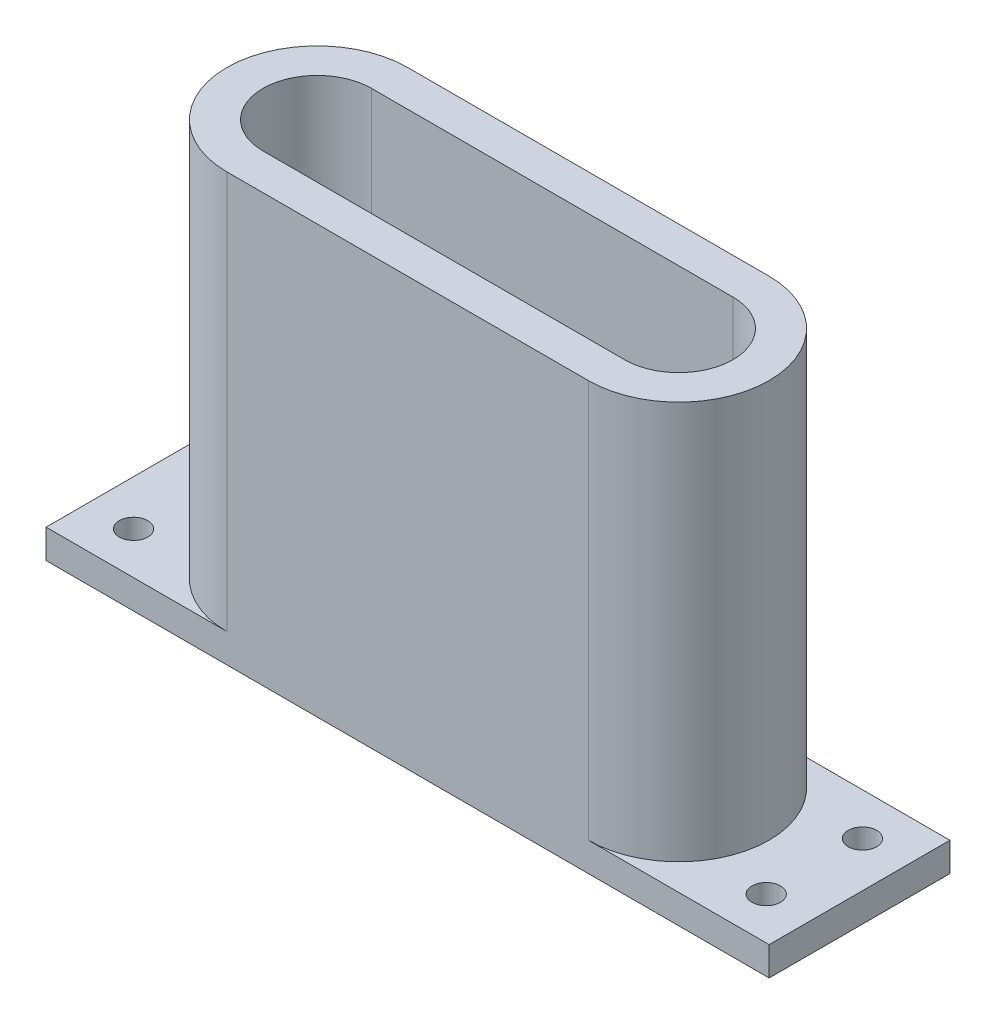
ISO-10303-21;
HEADER;
FILE_DESCRIPTION(('STEP AP214'),'2;1');
FILE_NAME('part.step','',(''),(''),'','','');
FILE_SCHEMA(('AUTOMOTIVE_DESIGN { 1 0 10303 214 1 1 1 1 }'));
ENDSEC;
DATA;
#1=APPLICATION_CONTEXT('core data for automotive mechanical design processes');
#2=APPLICATION_PROTOCOL_DEFINITION('international standard','automotive_design',2000,#1);
#3=PRODUCT_CONTEXT('',#1,'mechanical');
#4=PRODUCT('Part','Part','',(#3));
#5=PRODUCT_RELATED_PRODUCT_CATEGORY('part','',(#4));
#6=PRODUCT_DEFINITION_FORMATION('','',#4);
#7=PRODUCT_DEFINITION_CONTEXT('part definition',#1,'design');
#8=PRODUCT_DEFINITION('design','',#6,#7);
#9=PRODUCT_DEFINITION_SHAPE('','',#8);
#10=(LENGTH_UNIT() NAMED_UNIT(*) SI_UNIT(.MILLI.,.METRE.));
#11=(NAMED_UNIT(*) PLANE_ANGLE_UNIT() SI_UNIT($,.RADIAN.));
#12=(NAMED_UNIT(*) SI_UNIT($,.STERADIAN.) SOLID_ANGLE_UNIT());
#13=UNCERTAINTY_MEASURE_WITH_UNIT(LENGTH_MEASURE(1.E-05),#10,'distance_accuracy_value','');
#14=(GEOMETRIC_REPRESENTATION_CONTEXT(3) GLOBAL_UNCERTAINTY_ASSIGNED_CONTEXT((#13)) GLOBAL_UNIT_ASSIGNED_CONTEXT((#10,
#11,#12)) REPRESENTATION_CONTEXT('',''));
#15=CARTESIAN_POINT('',(0.,0.,0.));
#16=DIRECTION('',(0.,0.,1.));
#17=DIRECTION('',(1.,0.,0.));
#18=AXIS2_PLACEMENT_3D('',#15,#16,#17);
#19=CARTESIAN_POINT('',(-25.4,60.,0.));
#20=DIRECTION('',(0.,1.,0.));
#21=DIRECTION('',(0.,0.,1.));
#22=AXIS2_PLACEMENT_3D('',#19,#20,#21);
#23=PLANE('',#22);
#24=CARTESIAN_POINT('',(-25.4,60.,0.));
#25=DIRECTION('',(0.,1.,0.));
#26=DIRECTION('',(0.,0.,1.));
#27=AXIS2_PLACEMENT_3D('',#24,#25,#26);
#28=CIRCLE('',#27,12.7);
#29=CARTESIAN_POINT('',(-25.4,60.,-12.7));
#30=VERTEX_POINT('',#29);
#31=CARTESIAN_POINT('',(-25.4,60.,12.7));
#32=VERTEX_POINT('',#31);
#33=EDGE_CURVE('E209',#30,#32,#28,.T.);
#34=ORIENTED_EDGE('',*,*,#33,.T.);
#35=DIRECTION('',(1.,0.,0.));
#36=VECTOR('',#35,1.);
#37=CARTESIAN_POINT('',(-25.4,60.,12.7));
#38=LINE('',#37,#36);
#39=CARTESIAN_POINT('',(25.4,60.,12.7));
#40=VERTEX_POINT('',#39);
#41=EDGE_CURVE('E212',#32,#40,#38,.T.);
#42=ORIENTED_EDGE('',*,*,#41,.T.);
#43=CARTESIAN_POINT('',(25.4,60.,0.));
#44=DIRECTION('',(0.,1.,0.));
#45=DIRECTION('',(0.,0.,1.));
#46=AXIS2_PLACEMENT_3D('',#43,#44,#45);
#47=CIRCLE('',#46,12.7);
#48=CARTESIAN_POINT('',(25.4,60.,-12.7));
#49=VERTEX_POINT('',#48);
#50=EDGE_CURVE('E214',#40,#49,#47,.T.);
#51=ORIENTED_EDGE('',*,*,#50,.T.);
#52=DIRECTION('',(-1.,0.,0.));
#53=VECTOR('',#52,1.);
#54=CARTESIAN_POINT('',(-25.4,60.,-12.7));
#55=LINE('',#54,#53);
#56=EDGE_CURVE('E216',#49,#30,#55,.T.);
#57=ORIENTED_EDGE('',*,*,#56,.T.);
#58=EDGE_LOOP('',(#34,#42,#51,#57));
#59=FACE_BOUND('',#58,.T.);
#60=DIRECTION('',(1.,0.,0.));
#61=VECTOR('',#60,1.);
#62=CARTESIAN_POINT('',(-25.4,60.,7.61999999999998));
#63=LINE('',#62,#61);
#64=CARTESIAN_POINT('',(-25.4,60.,7.61999999999998));
#65=VERTEX_POINT('',#64);
#66=CARTESIAN_POINT('',(25.4000000000001,60.,7.62));
#67=VERTEX_POINT('',#66);
#68=EDGE_CURVE('E182',#65,#67,#63,.T.);
#69=ORIENTED_EDGE('',*,*,#68,.F.);
#70=CARTESIAN_POINT('',(-25.4,60.,0.));
#71=DIRECTION('',(0.,1.,0.));
#72=DIRECTION('',(0.,0.,1.));
#73=AXIS2_PLACEMENT_3D('',#70,#71,#72);
#74=CIRCLE('',#73,7.61999999999999);
#75=CARTESIAN_POINT('',(-25.4,60.,-7.61999999999999));
#76=VERTEX_POINT('',#75);
#77=EDGE_CURVE('E180',#76,#65,#74,.T.);
#78=ORIENTED_EDGE('',*,*,#77,.F.);
#79=DIRECTION('',(-1.,0.,0.));
#80=VECTOR('',#79,1.);
#81=CARTESIAN_POINT('',(-25.4,60.,-7.61999999999999));
#82=LINE('',#81,#80);
#83=CARTESIAN_POINT('',(25.4,60.,-7.62));
#84=VERTEX_POINT('',#83);
#85=EDGE_CURVE('E188',#84,#76,#82,.T.);
#86=ORIENTED_EDGE('',*,*,#85,.F.);
#87=CARTESIAN_POINT('',(25.4,60.,0.));
#88=DIRECTION('',(0.,1.,0.));
#89=DIRECTION('',(0.,0.,1.));
#90=AXIS2_PLACEMENT_3D('',#87,#88,#89);
#91=CIRCLE('',#90,7.62);
#92=EDGE_CURVE('E185',#67,#84,#91,.T.);
#93=ORIENTED_EDGE('',*,*,#92,.F.);
#94=EDGE_LOOP('',(#69,#78,#86,#93));
#95=FACE_BOUND('',#94,.T.);
#96=ADVANCED_FACE('F39',(#59,#95),#23,.T.);
#97=CARTESIAN_POINT('',(-25.4,0.,0.));
#98=DIRECTION('',(0.,1.,0.));
#99=DIRECTION('',(0.,0.,1.));
#100=AXIS2_PLACEMENT_3D('',#97,#98,#99);
#101=PLANE('',#100);
#102=DIRECTION('',(1.,0.,0.));
#103=VECTOR('',#102,1.);
#104=CARTESIAN_POINT('',(-25.4,0.,12.7));
#105=LINE('',#104,#103);
#106=CARTESIAN_POINT('',(-50.7999999999999,0.,12.7));
#107=VERTEX_POINT('',#106);
#108=CARTESIAN_POINT('',(50.8,0.,12.7));
#109=VERTEX_POINT('',#108);
#110=EDGE_CURVE('E208',#107,#109,#105,.T.);
#111=ORIENTED_EDGE('',*,*,#110,.F.);
#112=DIRECTION('',(0.,0.,-1.));
#113=VECTOR('',#112,1.);
#114=CARTESIAN_POINT('',(-50.7999999999999,0.,-12.7));
#115=LINE('',#114,#113);
#116=CARTESIAN_POINT('',(-50.7999999999999,0.,-12.7));
#117=VERTEX_POINT('',#116);
#118=EDGE_CURVE('E158',#107,#117,#115,.T.);
#119=ORIENTED_EDGE('',*,*,#118,.T.);
#120=DIRECTION('',(-1.,0.,0.));
#121=VECTOR('',#120,1.);
#122=CARTESIAN_POINT('',(-25.4,0.,-12.7));
#123=LINE('',#122,#121);
#124=CARTESIAN_POINT('',(50.8,0.,-12.7));
#125=VERTEX_POINT('',#124);
#126=EDGE_CURVE('E135',#125,#117,#123,.T.);
#127=ORIENTED_EDGE('',*,*,#126,.F.);
#128=DIRECTION('',(0.,0.,1.));
#129=VECTOR('',#128,1.);
#130=CARTESIAN_POINT('',(50.8,0.,-12.7));
#131=LINE('',#130,#129);
#132=EDGE_CURVE('E155',#125,#109,#131,.T.);
#133=ORIENTED_EDGE('',*,*,#132,.T.);
#134=EDGE_LOOP('',(#111,#119,#127,#133));
#135=FACE_BOUND('',#134,.T.);
#136=CARTESIAN_POINT('',(-25.4,0.,0.));
#137=DIRECTION('',(0.,1.,0.));
#138=DIRECTION('',(0.,0.,1.));
#139=AXIS2_PLACEMENT_3D('',#136,#137,#138);
#140=CIRCLE('',#139,7.61999999999999);
#141=CARTESIAN_POINT('',(-25.4,0.,-7.61999999999999));
#142=VERTEX_POINT('',#141);
#143=CARTESIAN_POINT('',(-25.4,0.,7.61999999999998));
#144=VERTEX_POINT('',#143);
#145=EDGE_CURVE('E179',#142,#144,#140,.T.);
#146=ORIENTED_EDGE('',*,*,#145,.T.);
#147=DIRECTION('',(1.,0.,0.));
#148=VECTOR('',#147,1.);
#149=CARTESIAN_POINT('',(-25.4,0.,7.61999999999998));
#150=LINE('',#149,#148);
#151=CARTESIAN_POINT('',(25.4000000000001,0.,7.62));
#152=VERTEX_POINT('',#151);
#153=EDGE_CURVE('E193',#144,#152,#150,.T.);
#154=ORIENTED_EDGE('',*,*,#153,.T.);
#155=CARTESIAN_POINT('',(25.4,0.,0.));
#156=DIRECTION('',(0.,1.,0.));
#157=DIRECTION('',(0.,0.,1.));
#158=AXIS2_PLACEMENT_3D('',#155,#156,#157);
#159=CIRCLE('',#158,7.62);
#160=CARTESIAN_POINT('',(25.4,0.,-7.62));
#161=VERTEX_POINT('',#160);
#162=EDGE_CURVE('E196',#152,#161,#159,.T.);
#163=ORIENTED_EDGE('',*,*,#162,.T.);
#164=DIRECTION('',(-1.,0.,0.));
#165=VECTOR('',#164,1.);
#166=CARTESIAN_POINT('',(-25.4,0.,-7.61999999999999));
#167=LINE('',#166,#165);
#168=EDGE_CURVE('E183',#161,#142,#167,.T.);
#169=ORIENTED_EDGE('',*,*,#168,.T.);
#170=EDGE_LOOP('',(#146,#154,#163,#169));
#171=FACE_BOUND('',#170,.T.);
#172=CARTESIAN_POINT('',(44.45,0.,6.76285674396147));
#173=DIRECTION('',(0.,-1.,0.));
#174=DIRECTION('',(0.,0.,1.));
#175=AXIS2_PLACEMENT_3D('',#172,#173,#174);
#176=CIRCLE('',#175,2.);
#177=CARTESIAN_POINT('',(44.45,0.,8.76285674396148));
#178=VERTEX_POINT('',#177);
#179=EDGE_CURVE('E306',#178,#178,#176,.T.);
#180=ORIENTED_EDGE('',*,*,#179,.F.);
#181=EDGE_LOOP('',(#180));
#182=FACE_BOUND('',#181,.T.);
#183=CARTESIAN_POINT('',(44.45,0.,-6.76285674396148));
#184=DIRECTION('',(0.,-1.,0.));
#185=DIRECTION('',(0.,0.,1.));
#186=AXIS2_PLACEMENT_3D('',#183,#184,#185);
#187=CIRCLE('',#186,2.);
#188=CARTESIAN_POINT('',(44.45,0.,-4.76285674396147));
#189=VERTEX_POINT('',#188);
#190=EDGE_CURVE('E303',#189,#189,#187,.T.);
#191=ORIENTED_EDGE('',*,*,#190,.F.);
#192=EDGE_LOOP('',(#191));
#193=FACE_BOUND('',#192,.T.);
#194=CARTESIAN_POINT('',(-44.45,0.,-6.76285674396148));
#195=DIRECTION('',(0.,-1.,0.));
#196=DIRECTION('',(0.,0.,-1.));
#197=AXIS2_PLACEMENT_3D('',#194,#195,#196);
#198=CIRCLE('',#197,2.);
#199=CARTESIAN_POINT('',(-44.45,0.,-8.76285674396148));
#200=VERTEX_POINT('',#199);
#201=EDGE_CURVE('E161',#200,#200,#198,.T.);
#202=ORIENTED_EDGE('',*,*,#201,.F.);
#203=EDGE_LOOP('',(#202));
#204=FACE_BOUND('',#203,.T.);
#205=CARTESIAN_POINT('',(-44.45,0.,6.76285674396147));
#206=DIRECTION('',(0.,-1.,0.));
#207=DIRECTION('',(0.,0.,-1.));
#208=AXIS2_PLACEMENT_3D('',#205,#206,#207);
#209=CIRCLE('',#208,2.);
#210=CARTESIAN_POINT('',(-44.45,0.,4.76285674396147));
#211=VERTEX_POINT('',#210);
#212=EDGE_CURVE('E312',#211,#211,#209,.T.);
#213=ORIENTED_EDGE('',*,*,#212,.F.);
#214=EDGE_LOOP('',(#213));
#215=FACE_BOUND('',#214,.T.);
#216=ADVANCED_FACE('F235',(#135,#171,#182,#193,#204,#215),#101,.F.);
#217=CARTESIAN_POINT('',(-25.4,60.,0.));
#218=DIRECTION('',(0.,-1.,0.));
#219=DIRECTION('',(0.,0.,-1.));
#220=AXIS2_PLACEMENT_3D('',#217,#218,#219);
#221=CYLINDRICAL_SURFACE('',#220,12.7);
#222=DIRECTION('',(0.,-1.,0.));
#223=VECTOR('',#222,1.);
#224=CARTESIAN_POINT('',(-25.4,60.,-12.7));
#225=LINE('',#224,#223);
#226=CARTESIAN_POINT('',(-25.4,4.064,-12.7));
#227=VERTEX_POINT('',#226);
#228=EDGE_CURVE('E218',#30,#227,#225,.T.);
#229=ORIENTED_EDGE('',*,*,#228,.T.);
#230=CARTESIAN_POINT('',(-25.4,4.064,0.));
#231=DIRECTION('',(0.,1.,0.));
#232=DIRECTION('',(0.,0.,1.));
#233=AXIS2_PLACEMENT_3D('',#230,#231,#232);
#234=CIRCLE('',#233,12.7);
#235=CARTESIAN_POINT('',(-25.4,4.064,12.7));
#236=VERTEX_POINT('',#235);
#237=EDGE_CURVE('E54',#227,#236,#234,.T.);
#238=ORIENTED_EDGE('',*,*,#237,.T.);
#239=DIRECTION('',(0.,-1.,0.));
#240=VECTOR('',#239,1.);
#241=CARTESIAN_POINT('',(-25.4,60.,12.7));
#242=LINE('',#241,#240);
#243=EDGE_CURVE('E11',#32,#236,#242,.T.);
#244=ORIENTED_EDGE('',*,*,#243,.F.);
#245=ORIENTED_EDGE('',*,*,#33,.F.);
#246=EDGE_LOOP('',(#229,#238,#244,#245));
#247=FACE_BOUND('',#246,.T.);
#248=ADVANCED_FACE('F41',(#247),#221,.T.);
#249=CARTESIAN_POINT('',(-25.4,60.,12.7));
#250=DIRECTION('',(0.,0.,-1.));
#251=DIRECTION('',(-1.,0.,0.));
#252=AXIS2_PLACEMENT_3D('',#249,#250,#251);
#253=PLANE('',#252);
#254=ORIENTED_EDGE('',*,*,#243,.T.);
#255=DIRECTION('',(-1.,0.,0.));
#256=VECTOR('',#255,1.);
#257=CARTESIAN_POINT('',(-50.7999999999999,4.064,12.7));
#258=LINE('',#257,#256);
#259=CARTESIAN_POINT('',(-50.7999999999999,4.064,12.7));
#260=VERTEX_POINT('',#259);
#261=EDGE_CURVE('E166',#236,#260,#258,.T.);
#262=ORIENTED_EDGE('',*,*,#261,.T.);
#263=DIRECTION('',(0.,-1.,0.));
#264=VECTOR('',#263,1.);
#265=CARTESIAN_POINT('',(-50.7999999999999,4.064,12.7));
#266=LINE('',#265,#264);
#267=EDGE_CURVE('E154',#260,#107,#266,.T.);
#268=ORIENTED_EDGE('',*,*,#267,.T.);
#269=ORIENTED_EDGE('',*,*,#110,.T.);
#270=DIRECTION('',(0.,-1.,0.));
#271=VECTOR('',#270,1.);
#272=CARTESIAN_POINT('',(50.8,4.064,12.7));
#273=LINE('',#272,#271);
#274=CARTESIAN_POINT('',(50.8,4.064,12.7));
#275=VERTEX_POINT('',#274);
#276=EDGE_CURVE('E173',#275,#109,#273,.T.);
#277=ORIENTED_EDGE('',*,*,#276,.F.);
#278=CARTESIAN_POINT('',(25.4,4.064,12.7));
#279=VERTEX_POINT('',#278);
#280=EDGE_CURVE('E141',#275,#279,#258,.T.);
#281=ORIENTED_EDGE('',*,*,#280,.T.);
#282=DIRECTION('',(0.,-1.,0.));
#283=VECTOR('',#282,1.);
#284=CARTESIAN_POINT('',(25.4,60.,12.7));
#285=LINE('',#284,#283);
#286=EDGE_CURVE('E47',#40,#279,#285,.T.);
#287=ORIENTED_EDGE('',*,*,#286,.F.);
#288=ORIENTED_EDGE('',*,*,#41,.F.);
#289=EDGE_LOOP('',(#254,#262,#268,#269,#277,#281,#287,#288));
#290=FACE_BOUND('',#289,.T.);
#291=ADVANCED_FACE('F238',(#290),#253,.F.);
#292=CARTESIAN_POINT('',(25.4,60.,0.));
#293=DIRECTION('',(0.,-1.,0.));
#294=DIRECTION('',(0.,0.,-1.));
#295=AXIS2_PLACEMENT_3D('',#292,#293,#294);
#296=CYLINDRICAL_SURFACE('',#295,12.7);
#297=ORIENTED_EDGE('',*,*,#286,.T.);
#298=CARTESIAN_POINT('',(25.4,4.064,0.));
#299=DIRECTION('',(0.,1.,0.));
#300=DIRECTION('',(0.,0.,1.));
#301=AXIS2_PLACEMENT_3D('',#298,#299,#300);
#302=CIRCLE('',#301,12.7);
#303=CARTESIAN_POINT('',(25.4,4.064,-12.7));
#304=VERTEX_POINT('',#303);
#305=EDGE_CURVE('E172',#279,#304,#302,.T.);
#306=ORIENTED_EDGE('',*,*,#305,.T.);
#307=DIRECTION('',(0.,-1.,0.));
#308=VECTOR('',#307,1.);
#309=CARTESIAN_POINT('',(25.4,60.,-12.7));
#310=LINE('',#309,#308);
#311=EDGE_CURVE('E222',#49,#304,#310,.T.);
#312=ORIENTED_EDGE('',*,*,#311,.F.);
#313=ORIENTED_EDGE('',*,*,#50,.F.);
#314=EDGE_LOOP('',(#297,#306,#312,#313));
#315=FACE_BOUND('',#314,.T.);
#316=ADVANCED_FACE('F242',(#315),#296,.T.);
#317=CARTESIAN_POINT('',(-25.4,60.,-12.7));
#318=DIRECTION('',(0.,0.,1.));
#319=DIRECTION('',(1.,0.,0.));
#320=AXIS2_PLACEMENT_3D('',#317,#318,#319);
#321=PLANE('',#320);
#322=ORIENTED_EDGE('',*,*,#311,.T.);
#323=DIRECTION('',(1.,0.,0.));
#324=VECTOR('',#323,1.);
#325=CARTESIAN_POINT('',(-50.7999999999999,4.064,-12.7));
#326=LINE('',#325,#324);
#327=CARTESIAN_POINT('',(50.8,4.064,-12.7));
#328=VERTEX_POINT('',#327);
#329=EDGE_CURVE('E149',#304,#328,#326,.T.);
#330=ORIENTED_EDGE('',*,*,#329,.T.);
#331=DIRECTION('',(0.,-1.,0.));
#332=VECTOR('',#331,1.);
#333=CARTESIAN_POINT('',(50.8,4.064,-12.7));
#334=LINE('',#333,#332);
#335=EDGE_CURVE('E140',#328,#125,#334,.T.);
#336=ORIENTED_EDGE('',*,*,#335,.T.);
#337=ORIENTED_EDGE('',*,*,#126,.T.);
#338=DIRECTION('',(0.,-1.,0.));
#339=VECTOR('',#338,1.);
#340=CARTESIAN_POINT('',(-50.7999999999999,4.064,-12.7));
#341=LINE('',#340,#339);
#342=CARTESIAN_POINT('',(-50.7999999999999,4.064,-12.7));
#343=VERTEX_POINT('',#342);
#344=EDGE_CURVE('E128',#343,#117,#341,.T.);
#345=ORIENTED_EDGE('',*,*,#344,.F.);
#346=EDGE_CURVE('E133',#343,#227,#326,.T.);
#347=ORIENTED_EDGE('',*,*,#346,.T.);
#348=ORIENTED_EDGE('',*,*,#228,.F.);
#349=ORIENTED_EDGE('',*,*,#56,.F.);
#350=EDGE_LOOP('',(#322,#330,#336,#337,#345,#347,#348,#349));
#351=FACE_BOUND('',#350,.T.);
#352=ADVANCED_FACE('F131',(#351),#321,.F.);
#353=CARTESIAN_POINT('',(-25.4,60.,0.));
#354=DIRECTION('',(0.,-1.,0.));
#355=DIRECTION('',(0.,0.,-1.));
#356=AXIS2_PLACEMENT_3D('',#353,#354,#355);
#357=CYLINDRICAL_SURFACE('',#356,7.61999999999999);
#358=DIRECTION('',(0.,-1.,0.));
#359=VECTOR('',#358,1.);
#360=CARTESIAN_POINT('',(-25.4,60.,7.61999999999998));
#361=LINE('',#360,#359);
#362=EDGE_CURVE('E206',#65,#144,#361,.T.);
#363=ORIENTED_EDGE('',*,*,#362,.T.);
#364=ORIENTED_EDGE('',*,*,#145,.F.);
#365=DIRECTION('',(0.,-1.,0.));
#366=VECTOR('',#365,1.);
#367=CARTESIAN_POINT('',(-25.4,60.,-7.61999999999999));
#368=LINE('',#367,#366);
#369=EDGE_CURVE('E190',#76,#142,#368,.T.);
#370=ORIENTED_EDGE('',*,*,#369,.F.);
#371=ORIENTED_EDGE('',*,*,#77,.T.);
#372=EDGE_LOOP('',(#363,#364,#370,#371));
#373=FACE_BOUND('',#372,.T.);
#374=ADVANCED_FACE('F249',(#373),#357,.F.);
#375=CARTESIAN_POINT('',(-25.4,60.,7.61999999999998));
#376=DIRECTION('',(0.,0.,-1.));
#377=DIRECTION('',(-1.,0.,0.));
#378=AXIS2_PLACEMENT_3D('',#375,#376,#377);
#379=PLANE('',#378);
#380=DIRECTION('',(0.,-1.,0.));
#381=VECTOR('',#380,1.);
#382=CARTESIAN_POINT('',(25.4000000000001,60.,7.62));
#383=LINE('',#382,#381);
#384=EDGE_CURVE('E204',#67,#152,#383,.T.);
#385=ORIENTED_EDGE('',*,*,#384,.T.);
#386=ORIENTED_EDGE('',*,*,#153,.F.);
#387=ORIENTED_EDGE('',*,*,#362,.F.);
#388=ORIENTED_EDGE('',*,*,#68,.T.);
#389=EDGE_LOOP('',(#385,#386,#387,#388));
#390=FACE_BOUND('',#389,.T.);
#391=ADVANCED_FACE('F260',(#390),#379,.T.);
#392=CARTESIAN_POINT('',(25.4,60.,0.));
#393=DIRECTION('',(0.,-1.,0.));
#394=DIRECTION('',(0.,0.,-1.));
#395=AXIS2_PLACEMENT_3D('',#392,#393,#394);
#396=CYLINDRICAL_SURFACE('',#395,7.62);
#397=DIRECTION('',(0.,-1.,0.));
#398=VECTOR('',#397,1.);
#399=CARTESIAN_POINT('',(25.4,60.,-7.62));
#400=LINE('',#399,#398);
#401=EDGE_CURVE('E202',#84,#161,#400,.T.);
#402=ORIENTED_EDGE('',*,*,#401,.T.);
#403=ORIENTED_EDGE('',*,*,#162,.F.);
#404=ORIENTED_EDGE('',*,*,#384,.F.);
#405=ORIENTED_EDGE('',*,*,#92,.T.);
#406=EDGE_LOOP('',(#402,#403,#404,#405));
#407=FACE_BOUND('',#406,.T.);
#408=ADVANCED_FACE('F264',(#407),#396,.F.);
#409=CARTESIAN_POINT('',(-25.4,60.,-7.61999999999999));
#410=DIRECTION('',(0.,0.,1.));
#411=DIRECTION('',(1.,0.,0.));
#412=AXIS2_PLACEMENT_3D('',#409,#410,#411);
#413=PLANE('',#412);
#414=ORIENTED_EDGE('',*,*,#369,.T.);
#415=ORIENTED_EDGE('',*,*,#168,.F.);
#416=ORIENTED_EDGE('',*,*,#401,.F.);
#417=ORIENTED_EDGE('',*,*,#85,.T.);
#418=EDGE_LOOP('',(#414,#415,#416,#417));
#419=FACE_BOUND('',#418,.T.);
#420=ADVANCED_FACE('F268',(#419),#413,.T.);
#421=CARTESIAN_POINT('',(50.8,4.064,-12.7));
#422=DIRECTION('',(1.,0.,0.));
#423=DIRECTION('',(0.,0.,-1.));
#424=AXIS2_PLACEMENT_3D('',#421,#422,#423);
#425=PLANE('',#424);
#426=ORIENTED_EDGE('',*,*,#132,.F.);
#427=ORIENTED_EDGE('',*,*,#335,.F.);
#428=DIRECTION('',(0.,0.,1.));
#429=VECTOR('',#428,1.);
#430=CARTESIAN_POINT('',(50.8,4.064,-12.7));
#431=LINE('',#430,#429);
#432=EDGE_CURVE('E148',#328,#275,#431,.T.);
#433=ORIENTED_EDGE('',*,*,#432,.T.);
#434=ORIENTED_EDGE('',*,*,#276,.T.);
#435=EDGE_LOOP('',(#426,#427,#433,#434));
#436=FACE_BOUND('',#435,.T.);
#437=ADVANCED_FACE('F233',(#436),#425,.T.);
#438=CARTESIAN_POINT('',(44.45,4.064,-6.76285674396148));
#439=DIRECTION('',(0.,-1.,0.));
#440=DIRECTION('',(0.,0.,-1.));
#441=AXIS2_PLACEMENT_3D('',#438,#439,#440);
#442=CYLINDRICAL_SURFACE('',#441,2.);
#443=CARTESIAN_POINT('',(44.45,4.064,-6.76285674396148));
#444=DIRECTION('',(0.,-1.,0.));
#445=DIRECTION('',(0.,0.,1.));
#446=AXIS2_PLACEMENT_3D('',#443,#444,#445);
#447=CIRCLE('',#446,2.);
#448=CARTESIAN_POINT('',(44.45,4.064,-4.76285674396147));
#449=VERTEX_POINT('',#448);
#450=EDGE_CURVE('E300',#449,#449,#447,.T.);
#451=ORIENTED_EDGE('',*,*,#450,.F.);
#452=EDGE_LOOP('',(#451));
#453=FACE_BOUND('',#452,.T.);
#454=ORIENTED_EDGE('',*,*,#190,.T.);
#455=EDGE_LOOP('',(#454));
#456=FACE_BOUND('',#455,.T.);
#457=ADVANCED_FACE('F278',(#453,#456),#442,.F.);
#458=CARTESIAN_POINT('',(44.45,4.064,6.76285674396147));
#459=DIRECTION('',(0.,-1.,0.));
#460=DIRECTION('',(0.,0.,-1.));
#461=AXIS2_PLACEMENT_3D('',#458,#459,#460);
#462=CYLINDRICAL_SURFACE('',#461,2.);
#463=CARTESIAN_POINT('',(44.45,4.064,6.76285674396147));
#464=DIRECTION('',(0.,-1.,0.));
#465=DIRECTION('',(0.,0.,1.));
#466=AXIS2_PLACEMENT_3D('',#463,#464,#465);
#467=CIRCLE('',#466,2.);
#468=CARTESIAN_POINT('',(44.45,4.064,8.76285674396148));
#469=VERTEX_POINT('',#468);
#470=EDGE_CURVE('E309',#469,#469,#467,.T.);
#471=ORIENTED_EDGE('',*,*,#470,.F.);
#472=EDGE_LOOP('',(#471));
#473=FACE_BOUND('',#472,.T.);
#474=ORIENTED_EDGE('',*,*,#179,.T.);
#475=EDGE_LOOP('',(#474));
#476=FACE_BOUND('',#475,.T.);
#477=ADVANCED_FACE('F289',(#473,#476),#462,.F.);
#478=CARTESIAN_POINT('',(0.,4.064,0.));
#479=DIRECTION('',(0.,1.,0.));
#480=DIRECTION('',(0.,0.,1.));
#481=AXIS2_PLACEMENT_3D('',#478,#479,#480);
#482=PLANE('',#481);
#483=ORIENTED_EDGE('',*,*,#470,.T.);
#484=EDGE_LOOP('',(#483));
#485=FACE_BOUND('',#484,.T.);
#486=ORIENTED_EDGE('',*,*,#450,.T.);
#487=EDGE_LOOP('',(#486));
#488=FACE_BOUND('',#487,.T.);
#489=ORIENTED_EDGE('',*,*,#305,.F.);
#490=ORIENTED_EDGE('',*,*,#280,.F.);
#491=ORIENTED_EDGE('',*,*,#432,.F.);
#492=ORIENTED_EDGE('',*,*,#329,.F.);
#493=EDGE_LOOP('',(#489,#490,#491,#492));
#494=FACE_BOUND('',#493,.T.);
#495=ADVANCED_FACE('F229',(#485,#488,#494),#482,.T.);
#496=CARTESIAN_POINT('',(-44.45,4.064,-6.76285674396148));
#497=DIRECTION('',(0.,-1.,0.));
#498=DIRECTION('',(0.,0.,-1.));
#499=AXIS2_PLACEMENT_3D('',#496,#497,#498);
#500=CIRCLE('',#499,2.);
#501=CARTESIAN_POINT('',(-44.45,4.064,-8.76285674396148));
#502=VERTEX_POINT('',#501);
#503=EDGE_CURVE('E169',#502,#502,#500,.T.);
#504=ORIENTED_EDGE('',*,*,#503,.T.);
#505=EDGE_LOOP('',(#504));
#506=FACE_BOUND('',#505,.T.);
#507=CARTESIAN_POINT('',(-44.45,4.064,6.76285674396147));
#508=DIRECTION('',(0.,-1.,0.));
#509=DIRECTION('',(0.,0.,-1.));
#510=AXIS2_PLACEMENT_3D('',#507,#508,#509);
#511=CIRCLE('',#510,2.);
#512=CARTESIAN_POINT('',(-44.45,4.064,4.76285674396147));
#513=VERTEX_POINT('',#512);
#514=EDGE_CURVE('E315',#513,#513,#511,.T.);
#515=ORIENTED_EDGE('',*,*,#514,.T.);
#516=EDGE_LOOP('',(#515));
#517=FACE_BOUND('',#516,.T.);
#518=ORIENTED_EDGE('',*,*,#237,.F.);
#519=ORIENTED_EDGE('',*,*,#346,.F.);
#520=DIRECTION('',(0.,0.,-1.));
#521=VECTOR('',#520,1.);
#522=CARTESIAN_POINT('',(-50.7999999999999,4.064,-12.7));
#523=LINE('',#522,#521);
#524=EDGE_CURVE('E147',#260,#343,#523,.T.);
#525=ORIENTED_EDGE('',*,*,#524,.F.);
#526=ORIENTED_EDGE('',*,*,#261,.F.);
#527=EDGE_LOOP('',(#518,#519,#525,#526));
#528=FACE_BOUND('',#527,.T.);
#529=ADVANCED_FACE('F145',(#506,#517,#528),#482,.T.);
#530=CARTESIAN_POINT('',(-50.7999999999999,4.064,-12.7));
#531=DIRECTION('',(-1.,0.,0.));
#532=DIRECTION('',(0.,0.,1.));
#533=AXIS2_PLACEMENT_3D('',#530,#531,#532);
#534=PLANE('',#533);
#535=ORIENTED_EDGE('',*,*,#118,.F.);
#536=ORIENTED_EDGE('',*,*,#267,.F.);
#537=ORIENTED_EDGE('',*,*,#524,.T.);
#538=ORIENTED_EDGE('',*,*,#344,.T.);
#539=EDGE_LOOP('',(#535,#536,#537,#538));
#540=FACE_BOUND('',#539,.T.);
#541=ADVANCED_FACE('F152',(#540),#534,.T.);
#542=CARTESIAN_POINT('',(-44.45,4.064,-6.76285674396148));
#543=DIRECTION('',(0.,-1.,0.));
#544=DIRECTION('',(0.,0.,-1.));
#545=AXIS2_PLACEMENT_3D('',#542,#543,#544);
#546=CYLINDRICAL_SURFACE('',#545,2.);
#547=ORIENTED_EDGE('',*,*,#503,.F.);
#548=EDGE_LOOP('',(#547));
#549=FACE_BOUND('',#548,.T.);
#550=ORIENTED_EDGE('',*,*,#201,.T.);
#551=EDGE_LOOP('',(#550));
#552=FACE_BOUND('',#551,.T.);
#553=ADVANCED_FACE('F275',(#549,#552),#546,.F.);
#554=CARTESIAN_POINT('',(-44.45,4.064,6.76285674396147));
#555=DIRECTION('',(0.,-1.,0.));
#556=DIRECTION('',(0.,0.,-1.));
#557=AXIS2_PLACEMENT_3D('',#554,#555,#556);
#558=CYLINDRICAL_SURFACE('',#557,2.);
#559=ORIENTED_EDGE('',*,*,#514,.F.);
#560=EDGE_LOOP('',(#559));
#561=FACE_BOUND('',#560,.T.);
#562=ORIENTED_EDGE('',*,*,#212,.T.);
#563=EDGE_LOOP('',(#562));
#564=FACE_BOUND('',#563,.T.);
#565=ADVANCED_FACE('F284',(#561,#564),#558,.F.);
#566=CLOSED_SHELL('',(#96,#216,#248,#291,#316,#352,#374,#391,#408,#420,#437,#457,#477,#495,#529,
#541,#553,#565));
#567=MANIFOLD_SOLID_BREP('B2',#566);
#568=ADVANCED_BREP_SHAPE_REPRESENTATION('',(#18,#567),#14);
#569=SHAPE_DEFINITION_REPRESENTATION(#9,#568);
ENDSEC;
END-ISO-10303-21;
